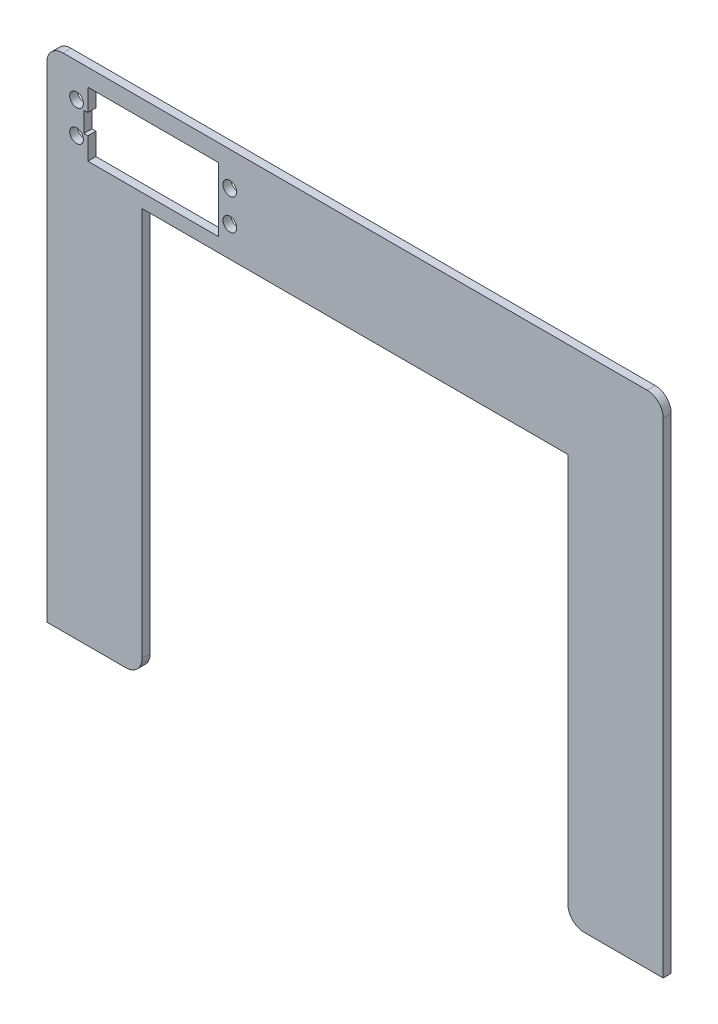
ISO-10303-21;
HEADER;
FILE_DESCRIPTION(('STEP AP214'),'2;1');
FILE_NAME('part.step','',(''),(''),'','','');
FILE_SCHEMA(('AUTOMOTIVE_DESIGN { 1 0 10303 214 1 1 1 1 }'));
ENDSEC;
DATA;
#1=APPLICATION_CONTEXT('core data for automotive mechanical design processes');
#2=APPLICATION_PROTOCOL_DEFINITION('international standard','automotive_design',2000,#1);
#3=PRODUCT_CONTEXT('',#1,'mechanical');
#4=PRODUCT('Part','Part','',(#3));
#5=PRODUCT_RELATED_PRODUCT_CATEGORY('part','',(#4));
#6=PRODUCT_DEFINITION_FORMATION('','',#4);
#7=PRODUCT_DEFINITION_CONTEXT('part definition',#1,'design');
#8=PRODUCT_DEFINITION('design','',#6,#7);
#9=PRODUCT_DEFINITION_SHAPE('','',#8);
#10=(LENGTH_UNIT() NAMED_UNIT(*) SI_UNIT(.MILLI.,.METRE.));
#11=(NAMED_UNIT(*) PLANE_ANGLE_UNIT() SI_UNIT($,.RADIAN.));
#12=(NAMED_UNIT(*) SI_UNIT($,.STERADIAN.) SOLID_ANGLE_UNIT());
#13=UNCERTAINTY_MEASURE_WITH_UNIT(LENGTH_MEASURE(1.E-05),#10,'distance_accuracy_value','');
#14=(GEOMETRIC_REPRESENTATION_CONTEXT(3) GLOBAL_UNCERTAINTY_ASSIGNED_CONTEXT((#13)) GLOBAL_UNIT_ASSIGNED_CONTEXT((#10,
#11,#12)) REPRESENTATION_CONTEXT('',''));
#15=CARTESIAN_POINT('',(0.,0.,0.));
#16=DIRECTION('',(0.,0.,1.));
#17=DIRECTION('',(1.,0.,0.));
#18=AXIS2_PLACEMENT_3D('',#15,#16,#17);
#19=CARTESIAN_POINT('',(-84.1083,73.4555,0.));
#20=DIRECTION('',(-1.,0.,0.));
#21=DIRECTION('',(0.,0.,1.));
#22=AXIS2_PLACEMENT_3D('',#19,#20,#21);
#23=PLANE('',#22);
#24=DIRECTION('',(0.,-1.,0.));
#25=VECTOR('',#24,1.);
#26=CARTESIAN_POINT('',(-84.1083,73.4555,2.54));
#27=LINE('',#26,#25);
#28=CARTESIAN_POINT('',(-84.1083,73.4555,2.54));
#29=VERTEX_POINT('',#28);
#30=CARTESIAN_POINT('',(-84.1083,66.534,2.54));
#31=VERTEX_POINT('',#30);
#32=EDGE_CURVE('E238',#29,#31,#27,.T.);
#33=ORIENTED_EDGE('',*,*,#32,.T.);
#34=DIRECTION('',(0.,0.,-1.));
#35=VECTOR('',#34,1.);
#36=CARTESIAN_POINT('',(-84.1083,66.534,0.));
#37=LINE('',#36,#35);
#38=CARTESIAN_POINT('',(-84.1083,66.534,0.));
#39=VERTEX_POINT('',#38);
#40=EDGE_CURVE('E11',#31,#39,#37,.T.);
#41=ORIENTED_EDGE('',*,*,#40,.T.);
#42=DIRECTION('',(0.,-1.,0.));
#43=VECTOR('',#42,1.);
#44=CARTESIAN_POINT('',(-84.1083,73.4555,0.));
#45=LINE('',#44,#43);
#46=CARTESIAN_POINT('',(-84.1083,73.4555,0.));
#47=VERTEX_POINT('',#46);
#48=EDGE_CURVE('E225',#47,#39,#45,.T.);
#49=ORIENTED_EDGE('',*,*,#48,.F.);
#50=DIRECTION('',(0.,0.,1.));
#51=VECTOR('',#50,1.);
#52=CARTESIAN_POINT('',(-84.1083,73.4555,0.));
#53=LINE('',#52,#51);
#54=EDGE_CURVE('E250',#47,#29,#53,.T.);
#55=ORIENTED_EDGE('',*,*,#54,.T.);
#56=EDGE_LOOP('',(#33,#41,#49,#55));
#57=FACE_BOUND('',#56,.T.);
#58=ADVANCED_FACE('F33',(#57),#23,.F.);
#59=CARTESIAN_POINT('',(-97.0433,-78.881,2.54));
#60=DIRECTION('',(1.,0.,0.));
#61=DIRECTION('',(0.,0.,-1.));
#62=AXIS2_PLACEMENT_3D('',#59,#60,#61);
#63=PLANE('',#62);
#64=DIRECTION('',(0.,-1.,0.));
#65=VECTOR('',#64,1.);
#66=CARTESIAN_POINT('',(-97.0433,-78.881,2.54));
#67=LINE('',#66,#65);
#68=CARTESIAN_POINT('',(-97.0433,73.801,2.54));
#69=VERTEX_POINT('',#68);
#70=CARTESIAN_POINT('',(-97.0433,-78.881,2.54));
#71=VERTEX_POINT('',#70);
#72=EDGE_CURVE('E259',#69,#71,#67,.T.);
#73=ORIENTED_EDGE('',*,*,#72,.F.);
#74=DIRECTION('',(0.,0.,-1.));
#75=VECTOR('',#74,1.);
#76=CARTESIAN_POINT('',(-97.0433,73.801,2.54));
#77=LINE('',#76,#75);
#78=CARTESIAN_POINT('',(-97.0433,73.801,0.));
#79=VERTEX_POINT('',#78);
#80=EDGE_CURVE('E331',#69,#79,#77,.T.);
#81=ORIENTED_EDGE('',*,*,#80,.T.);
#82=DIRECTION('',(0.,-1.,0.));
#83=VECTOR('',#82,1.);
#84=CARTESIAN_POINT('',(-97.0433,-78.881,0.));
#85=LINE('',#84,#83);
#86=CARTESIAN_POINT('',(-97.0433,-78.881,0.));
#87=VERTEX_POINT('',#86);
#88=EDGE_CURVE('E252',#79,#87,#85,.T.);
#89=ORIENTED_EDGE('',*,*,#88,.T.);
#90=DIRECTION('',(0.,0.,-1.));
#91=VECTOR('',#90,1.);
#92=CARTESIAN_POINT('',(-97.0433,-78.881,2.54));
#93=LINE('',#92,#91);
#94=EDGE_CURVE('E306',#71,#87,#93,.T.);
#95=ORIENTED_EDGE('',*,*,#94,.F.);
#96=EDGE_LOOP('',(#73,#81,#89,#95));
#97=FACE_BOUND('',#96,.T.);
#98=ADVANCED_FACE('F378',(#97),#63,.F.);
#99=CARTESIAN_POINT('',(-67.0433,-78.881,2.54));
#100=DIRECTION('',(0.,1.,0.));
#101=DIRECTION('',(-1.,0.,0.));
#102=AXIS2_PLACEMENT_3D('',#99,#100,#101);
#103=PLANE('',#102);
#104=DIRECTION('',(1.,0.,0.));
#105=VECTOR('',#104,1.);
#106=CARTESIAN_POINT('',(-67.0433,-78.881,0.));
#107=LINE('',#106,#105);
#108=CARTESIAN_POINT('',(-72.1233,-78.881,0.));
#109=VERTEX_POINT('',#108);
#110=EDGE_CURVE('E281',#87,#109,#107,.T.);
#111=ORIENTED_EDGE('',*,*,#110,.T.);
#112=DIRECTION('',(0.,0.,-1.));
#113=VECTOR('',#112,1.);
#114=CARTESIAN_POINT('',(-72.1233,-78.881,2.54));
#115=LINE('',#114,#113);
#116=CARTESIAN_POINT('',(-72.1233,-78.881,2.54));
#117=VERTEX_POINT('',#116);
#118=EDGE_CURVE('E342',#109,#117,#115,.F.);
#119=ORIENTED_EDGE('',*,*,#118,.T.);
#120=DIRECTION('',(1.,0.,0.));
#121=VECTOR('',#120,1.);
#122=CARTESIAN_POINT('',(-67.0433,-78.881,2.54));
#123=LINE('',#122,#121);
#124=EDGE_CURVE('E261',#71,#117,#123,.T.);
#125=ORIENTED_EDGE('',*,*,#124,.F.);
#126=ORIENTED_EDGE('',*,*,#94,.T.);
#127=EDGE_LOOP('',(#111,#119,#125,#126));
#128=FACE_BOUND('',#127,.T.);
#129=ADVANCED_FACE('F383',(#128),#103,.F.);
#130=CARTESIAN_POINT('',(-67.0433,48.881,2.54));
#131=DIRECTION('',(-1.,0.,0.));
#132=DIRECTION('',(0.,0.,1.));
#133=AXIS2_PLACEMENT_3D('',#130,#131,#132);
#134=PLANE('',#133);
#135=DIRECTION('',(0.,1.,0.));
#136=VECTOR('',#135,1.);
#137=CARTESIAN_POINT('',(-67.0433,48.881,2.54));
#138=LINE('',#137,#136);
#139=CARTESIAN_POINT('',(-67.0433,-73.801,2.54));
#140=VERTEX_POINT('',#139);
#141=CARTESIAN_POINT('',(-67.0433,48.881,2.54));
#142=VERTEX_POINT('',#141);
#143=EDGE_CURVE('E265',#140,#142,#138,.T.);
#144=ORIENTED_EDGE('',*,*,#143,.F.);
#145=DIRECTION('',(0.,0.,-1.));
#146=VECTOR('',#145,1.);
#147=CARTESIAN_POINT('',(-67.0433,-73.801,2.54));
#148=LINE('',#147,#146);
#149=CARTESIAN_POINT('',(-67.0433,-73.801,0.));
#150=VERTEX_POINT('',#149);
#151=EDGE_CURVE('E339',#140,#150,#148,.T.);
#152=ORIENTED_EDGE('',*,*,#151,.T.);
#153=DIRECTION('',(0.,1.,0.));
#154=VECTOR('',#153,1.);
#155=CARTESIAN_POINT('',(-67.0433,48.881,0.));
#156=LINE('',#155,#154);
#157=CARTESIAN_POINT('',(-67.0433,48.881,0.));
#158=VERTEX_POINT('',#157);
#159=EDGE_CURVE('E284',#150,#158,#156,.T.);
#160=ORIENTED_EDGE('',*,*,#159,.T.);
#161=DIRECTION('',(0.,0.,-1.));
#162=VECTOR('',#161,1.);
#163=CARTESIAN_POINT('',(-67.0433,48.881,2.54));
#164=LINE('',#163,#162);
#165=EDGE_CURVE('E303',#142,#158,#164,.T.);
#166=ORIENTED_EDGE('',*,*,#165,.F.);
#167=EDGE_LOOP('',(#144,#152,#160,#166));
#168=FACE_BOUND('',#167,.T.);
#169=ADVANCED_FACE('F420',(#168),#134,.F.);
#170=CARTESIAN_POINT('',(67.0433,48.881,2.54));
#171=DIRECTION('',(0.,1.,0.));
#172=DIRECTION('',(0.,0.,1.));
#173=AXIS2_PLACEMENT_3D('',#170,#171,#172);
#174=PLANE('',#173);
#175=DIRECTION('',(1.,0.,0.));
#176=VECTOR('',#175,1.);
#177=CARTESIAN_POINT('',(67.0433,48.881,0.));
#178=LINE('',#177,#176);
#179=CARTESIAN_POINT('',(67.0433,48.881,0.));
#180=VERTEX_POINT('',#179);
#181=EDGE_CURVE('E286',#158,#180,#178,.T.);
#182=ORIENTED_EDGE('',*,*,#181,.T.);
#183=DIRECTION('',(0.,0.,-1.));
#184=VECTOR('',#183,1.);
#185=CARTESIAN_POINT('',(67.0433,48.881,2.54));
#186=LINE('',#185,#184);
#187=CARTESIAN_POINT('',(67.0433,48.881,2.54));
#188=VERTEX_POINT('',#187);
#189=EDGE_CURVE('E300',#188,#180,#186,.T.);
#190=ORIENTED_EDGE('',*,*,#189,.F.);
#191=DIRECTION('',(1.,0.,0.));
#192=VECTOR('',#191,1.);
#193=CARTESIAN_POINT('',(67.0433,48.881,2.54));
#194=LINE('',#193,#192);
#195=EDGE_CURVE('E267',#142,#188,#194,.T.);
#196=ORIENTED_EDGE('',*,*,#195,.F.);
#197=ORIENTED_EDGE('',*,*,#165,.T.);
#198=EDGE_LOOP('',(#182,#190,#196,#197));
#199=FACE_BOUND('',#198,.T.);
#200=ADVANCED_FACE('F416',(#199),#174,.F.);
#201=CARTESIAN_POINT('',(67.0433,-78.881,2.54));
#202=DIRECTION('',(1.,0.,0.));
#203=DIRECTION('',(0.,0.,-1.));
#204=AXIS2_PLACEMENT_3D('',#201,#202,#203);
#205=PLANE('',#204);
#206=DIRECTION('',(0.,-1.,0.));
#207=VECTOR('',#206,1.);
#208=CARTESIAN_POINT('',(67.0433,-78.881,0.));
#209=LINE('',#208,#207);
#210=CARTESIAN_POINT('',(67.0433,-73.801,0.));
#211=VERTEX_POINT('',#210);
#212=EDGE_CURVE('E288',#180,#211,#209,.T.);
#213=ORIENTED_EDGE('',*,*,#212,.T.);
#214=DIRECTION('',(0.,0.,-1.));
#215=VECTOR('',#214,1.);
#216=CARTESIAN_POINT('',(67.0433,-73.801,2.54));
#217=LINE('',#216,#215);
#218=CARTESIAN_POINT('',(67.0433,-73.801,2.54));
#219=VERTEX_POINT('',#218);
#220=EDGE_CURVE('E337',#211,#219,#217,.F.);
#221=ORIENTED_EDGE('',*,*,#220,.T.);
#222=DIRECTION('',(0.,-1.,0.));
#223=VECTOR('',#222,1.);
#224=CARTESIAN_POINT('',(67.0433,-78.881,2.54));
#225=LINE('',#224,#223);
#226=EDGE_CURVE('E269',#188,#219,#225,.T.);
#227=ORIENTED_EDGE('',*,*,#226,.F.);
#228=ORIENTED_EDGE('',*,*,#189,.T.);
#229=EDGE_LOOP('',(#213,#221,#227,#228));
#230=FACE_BOUND('',#229,.T.);
#231=ADVANCED_FACE('F412',(#230),#205,.F.);
#232=CARTESIAN_POINT('',(97.0433,-78.881,2.54));
#233=DIRECTION('',(0.,1.,0.));
#234=DIRECTION('',(-1.,0.,0.));
#235=AXIS2_PLACEMENT_3D('',#232,#233,#234);
#236=PLANE('',#235);
#237=DIRECTION('',(1.,0.,0.));
#238=VECTOR('',#237,1.);
#239=CARTESIAN_POINT('',(97.0433,-78.881,2.54));
#240=LINE('',#239,#238);
#241=CARTESIAN_POINT('',(72.1233,-78.881,2.54));
#242=VERTEX_POINT('',#241);
#243=CARTESIAN_POINT('',(97.0433,-78.881,2.54));
#244=VERTEX_POINT('',#243);
#245=EDGE_CURVE('E271',#242,#244,#240,.T.);
#246=ORIENTED_EDGE('',*,*,#245,.F.);
#247=DIRECTION('',(0.,0.,-1.));
#248=VECTOR('',#247,1.);
#249=CARTESIAN_POINT('',(72.1233,-78.881,2.54));
#250=LINE('',#249,#248);
#251=CARTESIAN_POINT('',(72.1233,-78.881,0.));
#252=VERTEX_POINT('',#251);
#253=EDGE_CURVE('E334',#242,#252,#250,.T.);
#254=ORIENTED_EDGE('',*,*,#253,.T.);
#255=DIRECTION('',(1.,0.,0.));
#256=VECTOR('',#255,1.);
#257=CARTESIAN_POINT('',(97.0433,-78.881,0.));
#258=LINE('',#257,#256);
#259=CARTESIAN_POINT('',(97.0433,-78.881,0.));
#260=VERTEX_POINT('',#259);
#261=EDGE_CURVE('E291',#252,#260,#258,.T.);
#262=ORIENTED_EDGE('',*,*,#261,.T.);
#263=DIRECTION('',(0.,0.,-1.));
#264=VECTOR('',#263,1.);
#265=CARTESIAN_POINT('',(97.0433,-78.881,2.54));
#266=LINE('',#265,#264);
#267=EDGE_CURVE('E279',#244,#260,#266,.T.);
#268=ORIENTED_EDGE('',*,*,#267,.F.);
#269=EDGE_LOOP('',(#246,#254,#262,#268));
#270=FACE_BOUND('',#269,.T.);
#271=ADVANCED_FACE('F408',(#270),#236,.F.);
#272=CARTESIAN_POINT('',(97.0433,-78.881,2.54));
#273=DIRECTION('',(-1.,0.,0.));
#274=DIRECTION('',(0.,0.,1.));
#275=AXIS2_PLACEMENT_3D('',#272,#273,#274);
#276=PLANE('',#275);
#277=DIRECTION('',(0.,1.,0.));
#278=VECTOR('',#277,1.);
#279=CARTESIAN_POINT('',(97.0433,-78.881,0.));
#280=LINE('',#279,#278);
#281=CARTESIAN_POINT('',(97.0433,73.801,0.));
#282=VERTEX_POINT('',#281);
#283=EDGE_CURVE('E293',#260,#282,#280,.T.);
#284=ORIENTED_EDGE('',*,*,#283,.T.);
#285=DIRECTION('',(0.,0.,-1.));
#286=VECTOR('',#285,1.);
#287=CARTESIAN_POINT('',(97.0433,73.801,2.54));
#288=LINE('',#287,#286);
#289=CARTESIAN_POINT('',(97.0433,73.801,2.54));
#290=VERTEX_POINT('',#289);
#291=EDGE_CURVE('E322',#282,#290,#288,.F.);
#292=ORIENTED_EDGE('',*,*,#291,.T.);
#293=DIRECTION('',(0.,1.,0.));
#294=VECTOR('',#293,1.);
#295=CARTESIAN_POINT('',(97.0433,-78.881,2.54));
#296=LINE('',#295,#294);
#297=EDGE_CURVE('E273',#244,#290,#296,.T.);
#298=ORIENTED_EDGE('',*,*,#297,.F.);
#299=ORIENTED_EDGE('',*,*,#267,.T.);
#300=EDGE_LOOP('',(#284,#292,#298,#299));
#301=FACE_BOUND('',#300,.T.);
#302=ADVANCED_FACE('F404',(#301),#276,.F.);
#303=CARTESIAN_POINT('',(97.0433,78.881,2.54));
#304=DIRECTION('',(0.,-1.,0.));
#305=DIRECTION('',(0.,0.,-1.));
#306=AXIS2_PLACEMENT_3D('',#303,#304,#305);
#307=PLANE('',#306);
#308=DIRECTION('',(-1.,0.,0.));
#309=VECTOR('',#308,1.);
#310=CARTESIAN_POINT('',(97.0433,78.881,2.54));
#311=LINE('',#310,#309);
#312=CARTESIAN_POINT('',(91.9633,78.881,2.54));
#313=VERTEX_POINT('',#312);
#314=CARTESIAN_POINT('',(-91.9633,78.881,2.54));
#315=VERTEX_POINT('',#314);
#316=EDGE_CURVE('E276',#313,#315,#311,.T.);
#317=ORIENTED_EDGE('',*,*,#316,.F.);
#318=DIRECTION('',(0.,0.,-1.));
#319=VECTOR('',#318,1.);
#320=CARTESIAN_POINT('',(91.9633,78.881,2.54));
#321=LINE('',#320,#319);
#322=CARTESIAN_POINT('',(91.9633,78.881,0.));
#323=VERTEX_POINT('',#322);
#324=EDGE_CURVE('E311',#313,#323,#321,.T.);
#325=ORIENTED_EDGE('',*,*,#324,.T.);
#326=DIRECTION('',(-1.,0.,0.));
#327=VECTOR('',#326,1.);
#328=CARTESIAN_POINT('',(97.0433,78.881,0.));
#329=LINE('',#328,#327);
#330=CARTESIAN_POINT('',(-91.9633,78.881,0.));
#331=VERTEX_POINT('',#330);
#332=EDGE_CURVE('E262',#323,#331,#329,.T.);
#333=ORIENTED_EDGE('',*,*,#332,.T.);
#334=DIRECTION('',(0.,0.,-1.));
#335=VECTOR('',#334,1.);
#336=CARTESIAN_POINT('',(-91.9633,78.881,2.54));
#337=LINE('',#336,#335);
#338=EDGE_CURVE('E309',#331,#315,#337,.F.);
#339=ORIENTED_EDGE('',*,*,#338,.T.);
#340=EDGE_LOOP('',(#317,#325,#333,#339));
#341=FACE_BOUND('',#340,.T.);
#342=ADVANCED_FACE('F399',(#341),#307,.F.);
#343=CARTESIAN_POINT('',(0.,0.,2.54));
#344=DIRECTION('',(0.,0.,1.));
#345=DIRECTION('',(1.,0.,0.));
#346=AXIS2_PLACEMENT_3D('',#343,#344,#345);
#347=PLANE('',#346);
#348=DIRECTION('',(-1.,0.,0.));
#349=VECTOR('',#348,1.);
#350=CARTESIAN_POINT('',(-82.8383,66.534,2.54));
#351=LINE('',#350,#349);
#352=CARTESIAN_POINT('',(-85.3783,66.534,2.54));
#353=VERTEX_POINT('',#352);
#354=EDGE_CURVE('E192',#31,#353,#351,.T.);
#355=ORIENTED_EDGE('',*,*,#354,.F.);
#356=ORIENTED_EDGE('',*,*,#32,.F.);
#357=DIRECTION('',(-1.,0.,0.));
#358=VECTOR('',#357,1.);
#359=CARTESIAN_POINT('',(-42.9603,73.4555,2.54));
#360=LINE('',#359,#358);
#361=CARTESIAN_POINT('',(-42.9603,73.4555,2.54));
#362=VERTEX_POINT('',#361);
#363=EDGE_CURVE('E247',#362,#29,#360,.T.);
#364=ORIENTED_EDGE('',*,*,#363,.F.);
#365=DIRECTION('',(0.,1.,0.));
#366=VECTOR('',#365,1.);
#367=CARTESIAN_POINT('',(-42.9603,73.4555,2.54));
#368=LINE('',#367,#366);
#369=CARTESIAN_POINT('',(-42.9603,53.2625,2.54));
#370=VERTEX_POINT('',#369);
#371=EDGE_CURVE('E244',#370,#362,#368,.T.);
#372=ORIENTED_EDGE('',*,*,#371,.F.);
#373=DIRECTION('',(1.,0.,0.));
#374=VECTOR('',#373,1.);
#375=CARTESIAN_POINT('',(-42.9603,53.2625,2.54));
#376=LINE('',#375,#374);
#377=CARTESIAN_POINT('',(-84.1083,53.2625,2.54));
#378=VERTEX_POINT('',#377);
#379=EDGE_CURVE('E241',#378,#370,#376,.T.);
#380=ORIENTED_EDGE('',*,*,#379,.F.);
#381=CARTESIAN_POINT('',(-84.1083,60.184,2.54));
#382=VERTEX_POINT('',#381);
#383=EDGE_CURVE('E204',#382,#378,#27,.T.);
#384=ORIENTED_EDGE('',*,*,#383,.F.);
#385=DIRECTION('',(1.,0.,0.));
#386=VECTOR('',#385,1.);
#387=CARTESIAN_POINT('',(-82.8383,60.184,2.54));
#388=LINE('',#387,#386);
#389=CARTESIAN_POINT('',(-85.3783,60.184,2.54));
#390=VERTEX_POINT('',#389);
#391=EDGE_CURVE('E48',#390,#382,#388,.T.);
#392=ORIENTED_EDGE('',*,*,#391,.F.);
#393=DIRECTION('',(0.,-1.,0.));
#394=VECTOR('',#393,1.);
#395=CARTESIAN_POINT('',(-85.3783,60.184,2.54));
#396=LINE('',#395,#394);
#397=EDGE_CURVE('E179',#353,#390,#396,.T.);
#398=ORIENTED_EDGE('',*,*,#397,.F.);
#399=EDGE_LOOP('',(#355,#356,#364,#372,#380,#384,#392,#398));
#400=FACE_BOUND('',#399,.T.);
#401=CARTESIAN_POINT('',(-39.4043,58.4695,2.54));
#402=DIRECTION('',(0.,0.,1.));
#403=DIRECTION('',(1.,0.,0.));
#404=AXIS2_PLACEMENT_3D('',#401,#402,#403);
#405=CIRCLE('',#404,2.159);
#406=CARTESIAN_POINT('',(-37.2453,58.4695,2.54));
#407=VERTEX_POINT('',#406);
#408=EDGE_CURVE('E199',#407,#407,#405,.T.);
#409=ORIENTED_EDGE('',*,*,#408,.F.);
#410=EDGE_LOOP('',(#409));
#411=FACE_BOUND('',#410,.T.);
#412=CARTESIAN_POINT('',(-39.4043,68.2485,2.54));
#413=DIRECTION('',(0.,0.,1.));
#414=DIRECTION('',(1.,0.,0.));
#415=AXIS2_PLACEMENT_3D('',#412,#413,#414);
#416=CIRCLE('',#415,2.159);
#417=CARTESIAN_POINT('',(-37.2453,68.2485,2.54));
#418=VERTEX_POINT('',#417);
#419=EDGE_CURVE('E217',#418,#418,#416,.T.);
#420=ORIENTED_EDGE('',*,*,#419,.F.);
#421=EDGE_LOOP('',(#420));
#422=FACE_BOUND('',#421,.T.);
#423=CARTESIAN_POINT('',(-87.6643,58.4695,2.54));
#424=DIRECTION('',(0.,0.,1.));
#425=DIRECTION('',(1.,0.,0.));
#426=AXIS2_PLACEMENT_3D('',#423,#424,#425);
#427=CIRCLE('',#426,2.15900000000001);
#428=CARTESIAN_POINT('',(-85.5053,58.4695,2.54));
#429=VERTEX_POINT('',#428);
#430=EDGE_CURVE('E211',#429,#429,#427,.T.);
#431=ORIENTED_EDGE('',*,*,#430,.F.);
#432=EDGE_LOOP('',(#431));
#433=FACE_BOUND('',#432,.T.);
#434=CARTESIAN_POINT('',(-87.6643,68.2485,2.54));
#435=DIRECTION('',(0.,0.,1.));
#436=DIRECTION('',(1.,0.,0.));
#437=AXIS2_PLACEMENT_3D('',#434,#435,#436);
#438=CIRCLE('',#437,2.15900000000001);
#439=CARTESIAN_POINT('',(-85.5053,68.2485,2.54));
#440=VERTEX_POINT('',#439);
#441=EDGE_CURVE('E205',#440,#440,#438,.T.);
#442=ORIENTED_EDGE('',*,*,#441,.F.);
#443=EDGE_LOOP('',(#442));
#444=FACE_BOUND('',#443,.T.);
#445=ORIENTED_EDGE('',*,*,#297,.T.);
#446=CARTESIAN_POINT('',(91.9633,73.801,2.54));
#447=DIRECTION('',(0.,0.,1.));
#448=DIRECTION('',(1.,0.,0.));
#449=AXIS2_PLACEMENT_3D('',#446,#447,#448);
#450=CIRCLE('',#449,5.08);
#451=EDGE_CURVE('E329',#290,#313,#450,.T.);
#452=ORIENTED_EDGE('',*,*,#451,.T.);
#453=ORIENTED_EDGE('',*,*,#316,.T.);
#454=CARTESIAN_POINT('',(-91.9633,73.801,2.54));
#455=DIRECTION('',(0.,0.,1.));
#456=DIRECTION('',(1.,0.,0.));
#457=AXIS2_PLACEMENT_3D('',#454,#455,#456);
#458=CIRCLE('',#457,5.08);
#459=EDGE_CURVE('E327',#315,#69,#458,.T.);
#460=ORIENTED_EDGE('',*,*,#459,.T.);
#461=ORIENTED_EDGE('',*,*,#72,.T.);
#462=ORIENTED_EDGE('',*,*,#124,.T.);
#463=CARTESIAN_POINT('',(-72.1233,-73.801,2.54));
#464=DIRECTION('',(0.,0.,1.));
#465=DIRECTION('',(1.,0.,0.));
#466=AXIS2_PLACEMENT_3D('',#463,#464,#465);
#467=CIRCLE('',#466,5.08);
#468=EDGE_CURVE('E324',#117,#140,#467,.T.);
#469=ORIENTED_EDGE('',*,*,#468,.T.);
#470=ORIENTED_EDGE('',*,*,#143,.T.);
#471=ORIENTED_EDGE('',*,*,#195,.T.);
#472=ORIENTED_EDGE('',*,*,#226,.T.);
#473=CARTESIAN_POINT('',(72.1233,-73.801,2.54));
#474=DIRECTION('',(0.,0.,1.));
#475=DIRECTION('',(1.,0.,0.));
#476=AXIS2_PLACEMENT_3D('',#473,#474,#475);
#477=CIRCLE('',#476,5.08);
#478=EDGE_CURVE('E56',#219,#242,#477,.T.);
#479=ORIENTED_EDGE('',*,*,#478,.T.);
#480=ORIENTED_EDGE('',*,*,#245,.T.);
#481=EDGE_LOOP('',(#445,#452,#453,#460,#461,#462,#469,#470,#471,#472,#479,#480));
#482=FACE_BOUND('',#481,.T.);
#483=ADVANCED_FACE('F350',(#400,#411,#422,#433,#444,#482),#347,.T.);
#484=CARTESIAN_POINT('',(0.,0.,0.));
#485=DIRECTION('',(0.,0.,1.));
#486=DIRECTION('',(1.,0.,0.));
#487=AXIS2_PLACEMENT_3D('',#484,#485,#486);
#488=PLANE('',#487);
#489=CARTESIAN_POINT('',(-39.4043,58.4695,0.));
#490=DIRECTION('',(0.,0.,1.));
#491=DIRECTION('',(1.,0.,0.));
#492=AXIS2_PLACEMENT_3D('',#489,#490,#491);
#493=CIRCLE('',#492,2.159);
#494=CARTESIAN_POINT('',(-37.2453,58.4695,0.));
#495=VERTEX_POINT('',#494);
#496=EDGE_CURVE('E220',#495,#495,#493,.T.);
#497=ORIENTED_EDGE('',*,*,#496,.T.);
#498=EDGE_LOOP('',(#497));
#499=FACE_BOUND('',#498,.T.);
#500=CARTESIAN_POINT('',(-39.4043,68.2485,0.));
#501=DIRECTION('',(0.,0.,1.));
#502=DIRECTION('',(1.,0.,0.));
#503=AXIS2_PLACEMENT_3D('',#500,#501,#502);
#504=CIRCLE('',#503,2.159);
#505=CARTESIAN_POINT('',(-37.2453,68.2485,0.));
#506=VERTEX_POINT('',#505);
#507=EDGE_CURVE('E214',#506,#506,#504,.T.);
#508=ORIENTED_EDGE('',*,*,#507,.T.);
#509=EDGE_LOOP('',(#508));
#510=FACE_BOUND('',#509,.T.);
#511=CARTESIAN_POINT('',(-87.6643,58.4695,0.));
#512=DIRECTION('',(0.,0.,1.));
#513=DIRECTION('',(1.,0.,0.));
#514=AXIS2_PLACEMENT_3D('',#511,#512,#513);
#515=CIRCLE('',#514,2.15900000000001);
#516=CARTESIAN_POINT('',(-85.5053,58.4695,0.));
#517=VERTEX_POINT('',#516);
#518=EDGE_CURVE('E208',#517,#517,#515,.T.);
#519=ORIENTED_EDGE('',*,*,#518,.T.);
#520=EDGE_LOOP('',(#519));
#521=FACE_BOUND('',#520,.T.);
#522=CARTESIAN_POINT('',(-87.6643,68.2485,0.));
#523=DIRECTION('',(0.,0.,1.));
#524=DIRECTION('',(1.,0.,0.));
#525=AXIS2_PLACEMENT_3D('',#522,#523,#524);
#526=CIRCLE('',#525,2.15900000000001);
#527=CARTESIAN_POINT('',(-85.5053,68.2485,0.));
#528=VERTEX_POINT('',#527);
#529=EDGE_CURVE('E201',#528,#528,#526,.T.);
#530=ORIENTED_EDGE('',*,*,#529,.T.);
#531=EDGE_LOOP('',(#530));
#532=FACE_BOUND('',#531,.T.);
#533=ORIENTED_EDGE('',*,*,#48,.T.);
#534=DIRECTION('',(-1.,0.,0.));
#535=VECTOR('',#534,1.);
#536=CARTESIAN_POINT('',(-82.8383,66.534,0.));
#537=LINE('',#536,#535);
#538=CARTESIAN_POINT('',(-85.3783,66.534,0.));
#539=VERTEX_POINT('',#538);
#540=EDGE_CURVE('E181',#39,#539,#537,.T.);
#541=ORIENTED_EDGE('',*,*,#540,.T.);
#542=DIRECTION('',(0.,-1.,0.));
#543=VECTOR('',#542,1.);
#544=CARTESIAN_POINT('',(-85.3783,60.184,0.));
#545=LINE('',#544,#543);
#546=CARTESIAN_POINT('',(-85.3783,60.184,0.));
#547=VERTEX_POINT('',#546);
#548=EDGE_CURVE('E176',#539,#547,#545,.T.);
#549=ORIENTED_EDGE('',*,*,#548,.T.);
#550=DIRECTION('',(1.,0.,0.));
#551=VECTOR('',#550,1.);
#552=CARTESIAN_POINT('',(-82.8383,60.184,0.));
#553=LINE('',#552,#551);
#554=CARTESIAN_POINT('',(-84.1083,60.184,0.));
#555=VERTEX_POINT('',#554);
#556=EDGE_CURVE('E184',#547,#555,#553,.T.);
#557=ORIENTED_EDGE('',*,*,#556,.T.);
#558=CARTESIAN_POINT('',(-84.1083,53.2625,0.));
#559=VERTEX_POINT('',#558);
#560=EDGE_CURVE('E228',#555,#559,#45,.T.);
#561=ORIENTED_EDGE('',*,*,#560,.T.);
#562=DIRECTION('',(1.,0.,0.));
#563=VECTOR('',#562,1.);
#564=CARTESIAN_POINT('',(-42.9603,53.2625,0.));
#565=LINE('',#564,#563);
#566=CARTESIAN_POINT('',(-42.9603,53.2625,0.));
#567=VERTEX_POINT('',#566);
#568=EDGE_CURVE('E227',#559,#567,#565,.T.);
#569=ORIENTED_EDGE('',*,*,#568,.T.);
#570=DIRECTION('',(0.,1.,0.));
#571=VECTOR('',#570,1.);
#572=CARTESIAN_POINT('',(-42.9603,63.359,0.));
#573=LINE('',#572,#571);
#574=CARTESIAN_POINT('',(-42.9603,73.4555,0.));
#575=VERTEX_POINT('',#574);
#576=EDGE_CURVE('E231',#567,#575,#573,.T.);
#577=ORIENTED_EDGE('',*,*,#576,.T.);
#578=DIRECTION('',(-1.,0.,0.));
#579=VECTOR('',#578,1.);
#580=CARTESIAN_POINT('',(-42.9603,73.4555,0.));
#581=LINE('',#580,#579);
#582=EDGE_CURVE('E234',#575,#47,#581,.T.);
#583=ORIENTED_EDGE('',*,*,#582,.T.);
#584=EDGE_LOOP('',(#533,#541,#549,#557,#561,#569,#577,#583));
#585=FACE_BOUND('',#584,.T.);
#586=ORIENTED_EDGE('',*,*,#332,.F.);
#587=CARTESIAN_POINT('',(91.9633,73.801,0.));
#588=DIRECTION('',(0.,0.,1.));
#589=DIRECTION('',(1.,0.,0.));
#590=AXIS2_PLACEMENT_3D('',#587,#588,#589);
#591=CIRCLE('',#590,5.08);
#592=EDGE_CURVE('E320',#323,#282,#591,.F.);
#593=ORIENTED_EDGE('',*,*,#592,.T.);
#594=ORIENTED_EDGE('',*,*,#283,.F.);
#595=ORIENTED_EDGE('',*,*,#261,.F.);
#596=CARTESIAN_POINT('',(72.1233,-73.801,0.));
#597=DIRECTION('',(0.,0.,1.));
#598=DIRECTION('',(1.,0.,0.));
#599=AXIS2_PLACEMENT_3D('',#596,#597,#598);
#600=CIRCLE('',#599,5.08);
#601=EDGE_CURVE('E316',#252,#211,#600,.F.);
#602=ORIENTED_EDGE('',*,*,#601,.T.);
#603=ORIENTED_EDGE('',*,*,#212,.F.);
#604=ORIENTED_EDGE('',*,*,#181,.F.);
#605=ORIENTED_EDGE('',*,*,#159,.F.);
#606=CARTESIAN_POINT('',(-72.1233,-73.801,0.));
#607=DIRECTION('',(0.,0.,1.));
#608=DIRECTION('',(1.,0.,0.));
#609=AXIS2_PLACEMENT_3D('',#606,#607,#608);
#610=CIRCLE('',#609,5.08);
#611=EDGE_CURVE('E314',#150,#109,#610,.F.);
#612=ORIENTED_EDGE('',*,*,#611,.T.);
#613=ORIENTED_EDGE('',*,*,#110,.F.);
#614=ORIENTED_EDGE('',*,*,#88,.F.);
#615=CARTESIAN_POINT('',(-91.9633,73.801,0.));
#616=DIRECTION('',(0.,0.,1.));
#617=DIRECTION('',(1.,0.,0.));
#618=AXIS2_PLACEMENT_3D('',#615,#616,#617);
#619=CIRCLE('',#618,5.08);
#620=EDGE_CURVE('E318',#79,#331,#619,.F.);
#621=ORIENTED_EDGE('',*,*,#620,.T.);
#622=EDGE_LOOP('',(#586,#593,#594,#595,#602,#603,#604,#605,#612,#613,#614,#621));
#623=FACE_BOUND('',#622,.T.);
#624=ADVANCED_FACE('F190',(#499,#510,#521,#532,#585,#623),#488,.F.);
#625=ORIENTED_EDGE('',*,*,#560,.F.);
#626=DIRECTION('',(0.,0.,1.));
#627=VECTOR('',#626,1.);
#628=CARTESIAN_POINT('',(-84.1083,60.184,0.));
#629=LINE('',#628,#627);
#630=EDGE_CURVE('E41',#555,#382,#629,.T.);
#631=ORIENTED_EDGE('',*,*,#630,.T.);
#632=ORIENTED_EDGE('',*,*,#383,.T.);
#633=DIRECTION('',(0.,0.,1.));
#634=VECTOR('',#633,1.);
#635=CARTESIAN_POINT('',(-84.1083,53.2625,0.));
#636=LINE('',#635,#634);
#637=EDGE_CURVE('E237',#559,#378,#636,.T.);
#638=ORIENTED_EDGE('',*,*,#637,.F.);
#639=EDGE_LOOP('',(#625,#631,#632,#638));
#640=FACE_BOUND('',#639,.T.);
#641=ADVANCED_FACE('F345',(#640),#23,.F.);
#642=CARTESIAN_POINT('',(-42.9603,73.4555,0.));
#643=DIRECTION('',(0.,1.,0.));
#644=DIRECTION('',(0.,0.,1.));
#645=AXIS2_PLACEMENT_3D('',#642,#643,#644);
#646=PLANE('',#645);
#647=ORIENTED_EDGE('',*,*,#363,.T.);
#648=ORIENTED_EDGE('',*,*,#54,.F.);
#649=ORIENTED_EDGE('',*,*,#582,.F.);
#650=DIRECTION('',(0.,0.,1.));
#651=VECTOR('',#650,1.);
#652=CARTESIAN_POINT('',(-42.9603,73.4555,0.));
#653=LINE('',#652,#651);
#654=EDGE_CURVE('E253',#575,#362,#653,.T.);
#655=ORIENTED_EDGE('',*,*,#654,.T.);
#656=EDGE_LOOP('',(#647,#648,#649,#655));
#657=FACE_BOUND('',#656,.T.);
#658=ADVANCED_FACE('F362',(#657),#646,.F.);
#659=CARTESIAN_POINT('',(-42.9603,73.4555,0.));
#660=DIRECTION('',(1.,0.,0.));
#661=DIRECTION('',(0.,1.,0.));
#662=AXIS2_PLACEMENT_3D('',#659,#660,#661);
#663=PLANE('',#662);
#664=ORIENTED_EDGE('',*,*,#371,.T.);
#665=ORIENTED_EDGE('',*,*,#654,.F.);
#666=ORIENTED_EDGE('',*,*,#576,.F.);
#667=DIRECTION('',(0.,0.,1.));
#668=VECTOR('',#667,1.);
#669=CARTESIAN_POINT('',(-42.9603,53.2625,0.));
#670=LINE('',#669,#668);
#671=EDGE_CURVE('E255',#567,#370,#670,.T.);
#672=ORIENTED_EDGE('',*,*,#671,.T.);
#673=EDGE_LOOP('',(#664,#665,#666,#672));
#674=FACE_BOUND('',#673,.T.);
#675=ADVANCED_FACE('F360',(#674),#663,.F.);
#676=CARTESIAN_POINT('',(-42.9603,53.2625,0.));
#677=DIRECTION('',(0.,-1.,0.));
#678=DIRECTION('',(0.,0.,-1.));
#679=AXIS2_PLACEMENT_3D('',#676,#677,#678);
#680=PLANE('',#679);
#681=ORIENTED_EDGE('',*,*,#379,.T.);
#682=ORIENTED_EDGE('',*,*,#671,.F.);
#683=ORIENTED_EDGE('',*,*,#568,.F.);
#684=ORIENTED_EDGE('',*,*,#637,.T.);
#685=EDGE_LOOP('',(#681,#682,#683,#684));
#686=FACE_BOUND('',#685,.T.);
#687=ADVANCED_FACE('F356',(#686),#680,.F.);
#688=CARTESIAN_POINT('',(-87.6643,68.2485,0.));
#689=DIRECTION('',(0.,0.,1.));
#690=DIRECTION('',(1.,0.,0.));
#691=AXIS2_PLACEMENT_3D('',#688,#689,#690);
#692=CYLINDRICAL_SURFACE('',#691,2.15900000000001);
#693=ORIENTED_EDGE('',*,*,#529,.F.);
#694=EDGE_LOOP('',(#693));
#695=FACE_BOUND('',#694,.T.);
#696=ORIENTED_EDGE('',*,*,#441,.T.);
#697=EDGE_LOOP('',(#696));
#698=FACE_BOUND('',#697,.T.);
#699=ADVANCED_FACE('F519',(#695,#698),#692,.F.);
#700=CARTESIAN_POINT('',(-87.6643,58.4695,0.));
#701=DIRECTION('',(0.,0.,1.));
#702=DIRECTION('',(1.,0.,0.));
#703=AXIS2_PLACEMENT_3D('',#700,#701,#702);
#704=CYLINDRICAL_SURFACE('',#703,2.15900000000001);
#705=ORIENTED_EDGE('',*,*,#518,.F.);
#706=EDGE_LOOP('',(#705));
#707=FACE_BOUND('',#706,.T.);
#708=ORIENTED_EDGE('',*,*,#430,.T.);
#709=EDGE_LOOP('',(#708));
#710=FACE_BOUND('',#709,.T.);
#711=ADVANCED_FACE('F522',(#707,#710),#704,.F.);
#712=CARTESIAN_POINT('',(-39.4043,68.2485,0.));
#713=DIRECTION('',(0.,0.,1.));
#714=DIRECTION('',(1.,0.,0.));
#715=AXIS2_PLACEMENT_3D('',#712,#713,#714);
#716=CYLINDRICAL_SURFACE('',#715,2.159);
#717=ORIENTED_EDGE('',*,*,#507,.F.);
#718=EDGE_LOOP('',(#717));
#719=FACE_BOUND('',#718,.T.);
#720=ORIENTED_EDGE('',*,*,#419,.T.);
#721=EDGE_LOOP('',(#720));
#722=FACE_BOUND('',#721,.T.);
#723=ADVANCED_FACE('F526',(#719,#722),#716,.F.);
#724=CARTESIAN_POINT('',(-39.4043,58.4695,0.));
#725=DIRECTION('',(0.,0.,1.));
#726=DIRECTION('',(1.,0.,0.));
#727=AXIS2_PLACEMENT_3D('',#724,#725,#726);
#728=CYLINDRICAL_SURFACE('',#727,2.159);
#729=ORIENTED_EDGE('',*,*,#496,.F.);
#730=EDGE_LOOP('',(#729));
#731=FACE_BOUND('',#730,.T.);
#732=ORIENTED_EDGE('',*,*,#408,.T.);
#733=EDGE_LOOP('',(#732));
#734=FACE_BOUND('',#733,.T.);
#735=ADVANCED_FACE('F432',(#731,#734),#728,.F.);
#736=CARTESIAN_POINT('',(91.9633,73.801,2.54));
#737=DIRECTION('',(0.,0.,-1.));
#738=DIRECTION('',(-1.,0.,0.));
#739=AXIS2_PLACEMENT_3D('',#736,#737,#738);
#740=CYLINDRICAL_SURFACE('',#739,5.08);
#741=ORIENTED_EDGE('',*,*,#451,.F.);
#742=ORIENTED_EDGE('',*,*,#291,.F.);
#743=ORIENTED_EDGE('',*,*,#592,.F.);
#744=ORIENTED_EDGE('',*,*,#324,.F.);
#745=EDGE_LOOP('',(#741,#742,#743,#744));
#746=FACE_BOUND('',#745,.T.);
#747=ADVANCED_FACE('F428',(#746),#740,.T.);
#748=CARTESIAN_POINT('',(-91.9633,73.801,2.54));
#749=DIRECTION('',(0.,0.,-1.));
#750=DIRECTION('',(-1.,0.,0.));
#751=AXIS2_PLACEMENT_3D('',#748,#749,#750);
#752=CYLINDRICAL_SURFACE('',#751,5.08);
#753=ORIENTED_EDGE('',*,*,#459,.F.);
#754=ORIENTED_EDGE('',*,*,#338,.F.);
#755=ORIENTED_EDGE('',*,*,#620,.F.);
#756=ORIENTED_EDGE('',*,*,#80,.F.);
#757=EDGE_LOOP('',(#753,#754,#755,#756));
#758=FACE_BOUND('',#757,.T.);
#759=ADVANCED_FACE('F431',(#758),#752,.T.);
#760=CARTESIAN_POINT('',(72.1233,-73.801,2.54));
#761=DIRECTION('',(0.,0.,-1.));
#762=DIRECTION('',(-1.,0.,0.));
#763=AXIS2_PLACEMENT_3D('',#760,#761,#762);
#764=CYLINDRICAL_SURFACE('',#763,5.08);
#765=ORIENTED_EDGE('',*,*,#478,.F.);
#766=ORIENTED_EDGE('',*,*,#220,.F.);
#767=ORIENTED_EDGE('',*,*,#601,.F.);
#768=ORIENTED_EDGE('',*,*,#253,.F.);
#769=EDGE_LOOP('',(#765,#766,#767,#768));
#770=FACE_BOUND('',#769,.T.);
#771=ADVANCED_FACE('F375',(#770),#764,.T.);
#772=CARTESIAN_POINT('',(-72.1233,-73.801,2.54));
#773=DIRECTION('',(0.,0.,-1.));
#774=DIRECTION('',(-1.,0.,0.));
#775=AXIS2_PLACEMENT_3D('',#772,#773,#774);
#776=CYLINDRICAL_SURFACE('',#775,5.08);
#777=ORIENTED_EDGE('',*,*,#468,.F.);
#778=ORIENTED_EDGE('',*,*,#118,.F.);
#779=ORIENTED_EDGE('',*,*,#611,.F.);
#780=ORIENTED_EDGE('',*,*,#151,.F.);
#781=EDGE_LOOP('',(#777,#778,#779,#780));
#782=FACE_BOUND('',#781,.T.);
#783=ADVANCED_FACE('F35',(#782),#776,.T.);
#784=CARTESIAN_POINT('',(-82.8383,66.534,0.));
#785=DIRECTION('',(0.,1.,0.));
#786=DIRECTION('',(0.,0.,1.));
#787=AXIS2_PLACEMENT_3D('',#784,#785,#786);
#788=PLANE('',#787);
#789=ORIENTED_EDGE('',*,*,#354,.T.);
#790=DIRECTION('',(0.,0.,1.));
#791=VECTOR('',#790,1.);
#792=CARTESIAN_POINT('',(-85.3783,66.534,0.));
#793=LINE('',#792,#791);
#794=EDGE_CURVE('E180',#539,#353,#793,.T.);
#795=ORIENTED_EDGE('',*,*,#794,.F.);
#796=ORIENTED_EDGE('',*,*,#540,.F.);
#797=ORIENTED_EDGE('',*,*,#40,.F.);
#798=EDGE_LOOP('',(#789,#795,#796,#797));
#799=FACE_BOUND('',#798,.T.);
#800=ADVANCED_FACE('F367',(#799),#788,.F.);
#801=CARTESIAN_POINT('',(-82.8383,60.184,0.));
#802=DIRECTION('',(0.,-1.,0.));
#803=DIRECTION('',(0.,0.,-1.));
#804=AXIS2_PLACEMENT_3D('',#801,#802,#803);
#805=PLANE('',#804);
#806=ORIENTED_EDGE('',*,*,#556,.F.);
#807=DIRECTION('',(0.,0.,1.));
#808=VECTOR('',#807,1.);
#809=CARTESIAN_POINT('',(-85.3783,60.184,0.));
#810=LINE('',#809,#808);
#811=EDGE_CURVE('E171',#547,#390,#810,.T.);
#812=ORIENTED_EDGE('',*,*,#811,.T.);
#813=ORIENTED_EDGE('',*,*,#391,.T.);
#814=ORIENTED_EDGE('',*,*,#630,.F.);
#815=EDGE_LOOP('',(#806,#812,#813,#814));
#816=FACE_BOUND('',#815,.T.);
#817=ADVANCED_FACE('F185',(#816),#805,.F.);
#818=CARTESIAN_POINT('',(-85.3783,60.184,0.));
#819=DIRECTION('',(-1.,0.,0.));
#820=DIRECTION('',(0.,0.,1.));
#821=AXIS2_PLACEMENT_3D('',#818,#819,#820);
#822=PLANE('',#821);
#823=ORIENTED_EDGE('',*,*,#397,.T.);
#824=ORIENTED_EDGE('',*,*,#811,.F.);
#825=ORIENTED_EDGE('',*,*,#548,.F.);
#826=ORIENTED_EDGE('',*,*,#794,.T.);
#827=EDGE_LOOP('',(#823,#824,#825,#826));
#828=FACE_BOUND('',#827,.T.);
#829=ADVANCED_FACE('F173',(#828),#822,.F.);
#830=CLOSED_SHELL('',(#58,#98,#129,#169,#200,#231,#271,#302,#342,#483,#624,#641,#658,#675,#687,
#699,#711,#723,#735,#747,#759,#771,#783,#800,#817,#829));
#831=MANIFOLD_SOLID_BREP('B2',#830);
#832=ADVANCED_BREP_SHAPE_REPRESENTATION('',(#18,#831),#14);
#833=SHAPE_DEFINITION_REPRESENTATION(#9,#832);
ENDSEC;
END-ISO-10303-21;
